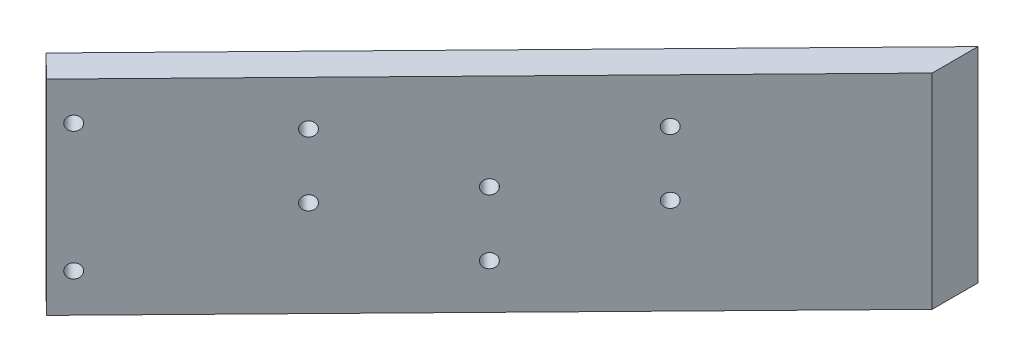
ISO-10303-21;
HEADER;
FILE_DESCRIPTION(('STEP AP214'),'2;1');
FILE_NAME('part.step','',(''),(''),'','','');
FILE_SCHEMA(('AUTOMOTIVE_DESIGN { 1 0 10303 214 1 1 1 1 }'));
ENDSEC;
DATA;
#1=APPLICATION_CONTEXT('core data for automotive mechanical design processes');
#2=APPLICATION_PROTOCOL_DEFINITION('international standard','automotive_design',2000,#1);
#3=PRODUCT_CONTEXT('',#1,'mechanical');
#4=PRODUCT('Part','Part','',(#3));
#5=PRODUCT_RELATED_PRODUCT_CATEGORY('part','',(#4));
#6=PRODUCT_DEFINITION_FORMATION('','',#4);
#7=PRODUCT_DEFINITION_CONTEXT('part definition',#1,'design');
#8=PRODUCT_DEFINITION('design','',#6,#7);
#9=PRODUCT_DEFINITION_SHAPE('','',#8);
#10=(LENGTH_UNIT() NAMED_UNIT(*) SI_UNIT(.MILLI.,.METRE.));
#11=(NAMED_UNIT(*) PLANE_ANGLE_UNIT() SI_UNIT($,.RADIAN.));
#12=(NAMED_UNIT(*) SI_UNIT($,.STERADIAN.) SOLID_ANGLE_UNIT());
#13=UNCERTAINTY_MEASURE_WITH_UNIT(LENGTH_MEASURE(1.E-05),#10,'distance_accuracy_value','');
#14=(GEOMETRIC_REPRESENTATION_CONTEXT(3) GLOBAL_UNCERTAINTY_ASSIGNED_CONTEXT((#13)) GLOBAL_UNIT_ASSIGNED_CONTEXT((#10,
#11,#12)) REPRESENTATION_CONTEXT('',''));
#15=CARTESIAN_POINT('',(0.,0.,0.));
#16=DIRECTION('',(0.,0.,1.));
#17=DIRECTION('',(1.,0.,0.));
#18=AXIS2_PLACEMENT_3D('',#15,#16,#17);
#19=CARTESIAN_POINT('',(0.,32.,-30.));
#20=DIRECTION('',(0.715474021164313,0.,0.698639338313388));
#21=DIRECTION('',(0.698639338313388,0.,-0.715474021164313));
#22=AXIS2_PLACEMENT_3D('',#19,#20,#21);
#23=PLANE('',#22);
#24=CARTESIAN_POINT('',(45.2113149470892,7.,-76.3007442229227));
#25=DIRECTION('',(0.715474021164313,0.,0.698639338313388));
#26=DIRECTION('',(0.698639338313388,0.,-0.715474021164313));
#27=AXIS2_PLACEMENT_3D('',#24,#25,#26);
#28=CIRCLE('',#27,1.10000000000001);
#29=CARTESIAN_POINT('',(45.9798182192339,7.,-77.0877656462034));
#30=VERTEX_POINT('',#29);
#31=EDGE_CURVE('E107',#30,#30,#28,.T.);
#32=ORIENTED_EDGE('',*,*,#31,.T.);
#33=EDGE_LOOP('',(#32));
#34=FACE_BOUND('',#33,.T.);
#35=CARTESIAN_POINT('',(31.2385281808215,15.,-61.9912637996364));
#36=DIRECTION('',(0.715474021164313,0.,0.698639338313388));
#37=DIRECTION('',(0.698639338313388,0.,-0.715474021164313));
#38=AXIS2_PLACEMENT_3D('',#35,#36,#37);
#39=CIRCLE('',#38,1.1);
#40=CARTESIAN_POINT('',(32.0070314529662,15.,-62.7782852229172));
#41=VERTEX_POINT('',#40);
#42=EDGE_CURVE('E152',#41,#41,#39,.T.);
#43=ORIENTED_EDGE('',*,*,#42,.T.);
#44=EDGE_LOOP('',(#43));
#45=FACE_BOUND('',#44,.T.);
#46=CARTESIAN_POINT('',(31.2385281808215,25.,-61.9912637996364));
#47=DIRECTION('',(0.715474021164313,0.,0.698639338313388));
#48=DIRECTION('',(0.698639338313388,0.,-0.715474021164313));
#49=AXIS2_PLACEMENT_3D('',#46,#47,#48);
#50=CIRCLE('',#49,1.1);
#51=CARTESIAN_POINT('',(32.0070314529662,25.,-62.7782852229172));
#52=VERTEX_POINT('',#51);
#53=EDGE_CURVE('E156',#52,#52,#50,.T.);
#54=ORIENTED_EDGE('',*,*,#53,.T.);
#55=EDGE_LOOP('',(#54));
#56=FACE_BOUND('',#55,.T.);
#57=CARTESIAN_POINT('',(59.184101713357,25.,-90.6102246462089));
#58=DIRECTION('',(0.715474021164313,0.,0.698639338313388));
#59=DIRECTION('',(0.698639338313388,0.,-0.715474021164313));
#60=AXIS2_PLACEMENT_3D('',#57,#58,#59);
#61=CIRCLE('',#60,1.10000000000001);
#62=CARTESIAN_POINT('',(59.9526049855017,25.,-91.3972460694897));
#63=VERTEX_POINT('',#62);
#64=EDGE_CURVE('E160',#63,#63,#61,.T.);
#65=ORIENTED_EDGE('',*,*,#64,.T.);
#66=EDGE_LOOP('',(#65));
#67=FACE_BOUND('',#66,.T.);
#68=CARTESIAN_POINT('',(59.184101713357,15.,-90.6102246462089));
#69=DIRECTION('',(0.715474021164313,0.,0.698639338313388));
#70=DIRECTION('',(0.698639338313388,0.,-0.715474021164313));
#71=AXIS2_PLACEMENT_3D('',#68,#69,#70);
#72=CIRCLE('',#71,1.10000000000001);
#73=CARTESIAN_POINT('',(59.9526049855017,15.,-91.3972460694897));
#74=VERTEX_POINT('',#73);
#75=EDGE_CURVE('E164',#74,#74,#72,.T.);
#76=ORIENTED_EDGE('',*,*,#75,.T.);
#77=EDGE_LOOP('',(#76));
#78=FACE_BOUND('',#77,.T.);
#79=CARTESIAN_POINT('',(45.2113149470892,17.,-76.3007442229227));
#80=DIRECTION('',(0.715474021164313,0.,0.698639338313388));
#81=DIRECTION('',(0.698639338313388,0.,-0.715474021164313));
#82=AXIS2_PLACEMENT_3D('',#79,#80,#81);
#83=CIRCLE('',#82,1.10000000000001);
#84=CARTESIAN_POINT('',(45.9798182192339,17.,-77.0877656462034));
#85=VERTEX_POINT('',#84);
#86=EDGE_CURVE('E168',#85,#85,#83,.T.);
#87=ORIENTED_EDGE('',*,*,#86,.T.);
#88=EDGE_LOOP('',(#87));
#89=FACE_BOUND('',#88,.T.);
#90=CARTESIAN_POINT('',(13.0959180149402,26.,-43.4114823044568));
#91=DIRECTION('',(-0.715474021164313,0.,-0.698639338313388));
#92=DIRECTION('',(-0.698639338313388,0.,0.715474021164313));
#93=AXIS2_PLACEMENT_3D('',#90,#91,#92);
#94=CIRCLE('',#93,1.1);
#95=CARTESIAN_POINT('',(12.3274147427954,26.,-42.624460881176));
#96=VERTEX_POINT('',#95);
#97=EDGE_CURVE('E96',#96,#96,#94,.T.);
#98=ORIENTED_EDGE('',*,*,#97,.F.);
#99=EDGE_LOOP('',(#98));
#100=FACE_BOUND('',#99,.T.);
#101=CARTESIAN_POINT('',(13.0959180149402,6.,-43.4114823044568));
#102=DIRECTION('',(-0.715474021164313,0.,-0.698639338313388));
#103=DIRECTION('',(0.698639338313388,0.,-0.715474021164313));
#104=AXIS2_PLACEMENT_3D('',#101,#102,#103);
#105=CIRCLE('',#104,1.1);
#106=CARTESIAN_POINT('',(13.8644212870849,6.,-44.1985037277375));
#107=VERTEX_POINT('',#106);
#108=EDGE_CURVE('E102',#107,#107,#105,.T.);
#109=ORIENTED_EDGE('',*,*,#108,.F.);
#110=EDGE_LOOP('',(#109));
#111=FACE_BOUND('',#110,.T.);
#112=DIRECTION('',(0.,1.,0.));
#113=VECTOR('',#112,1.);
#114=CARTESIAN_POINT('',(11.,0.,-41.2650602409638));
#115=LINE('',#114,#113);
#116=CARTESIAN_POINT('',(11.,0.,-41.2650602409638));
#117=VERTEX_POINT('',#116);
#118=CARTESIAN_POINT('',(11.,32.,-41.2650602409638));
#119=VERTEX_POINT('',#118);
#120=EDGE_CURVE('E50',#117,#119,#115,.T.);
#121=ORIENTED_EDGE('',*,*,#120,.T.);
#122=DIRECTION('',(-0.698639338313388,0.,0.715474021164313));
#123=VECTOR('',#122,1.);
#124=CARTESIAN_POINT('',(0.,32.,-30.));
#125=LINE('',#124,#123);
#126=CARTESIAN_POINT('',(83.,32.,-115.));
#127=VERTEX_POINT('',#126);
#128=EDGE_CURVE('E79',#127,#119,#125,.T.);
#129=ORIENTED_EDGE('',*,*,#128,.F.);
#130=DIRECTION('',(0.,-1.,0.));
#131=VECTOR('',#130,1.);
#132=CARTESIAN_POINT('',(83.,32.,-115.));
#133=LINE('',#132,#131);
#134=CARTESIAN_POINT('',(83.,0.,-115.));
#135=VERTEX_POINT('',#134);
#136=EDGE_CURVE('E42',#127,#135,#133,.T.);
#137=ORIENTED_EDGE('',*,*,#136,.T.);
#138=DIRECTION('',(-0.698639338313388,0.,0.715474021164313));
#139=VECTOR('',#138,1.);
#140=CARTESIAN_POINT('',(0.,0.,-30.));
#141=LINE('',#140,#139);
#142=EDGE_CURVE('E84',#135,#117,#141,.T.);
#143=ORIENTED_EDGE('',*,*,#142,.T.);
#144=EDGE_LOOP('',(#121,#129,#137,#143));
#145=FACE_BOUND('',#144,.T.);
#146=ADVANCED_FACE('F34',(#34,#45,#56,#67,#78,#89,#100,#111,#145),#23,.F.);
#147=CARTESIAN_POINT('',(5.,32.,-27.9637134410254));
#148=DIRECTION('',(-0.715474021164313,0.,-0.698639338313388));
#149=DIRECTION('',(-0.698639338313388,0.,0.715474021164313));
#150=AXIS2_PLACEMENT_3D('',#147,#148,#149);
#151=PLANE('',#150);
#152=CARTESIAN_POINT('',(48.7886850529108,7.,-72.8075475313557));
#153=DIRECTION('',(0.715474021164313,0.,0.698639338313388));
#154=DIRECTION('',(-0.698639338313388,0.,0.715474021164313));
#155=AXIS2_PLACEMENT_3D('',#152,#153,#154);
#156=CIRCLE('',#155,1.10000000000001);
#157=CARTESIAN_POINT('',(48.020181780766,7.,-72.020526108075));
#158=VERTEX_POINT('',#157);
#159=EDGE_CURVE('E182',#158,#158,#156,.T.);
#160=ORIENTED_EDGE('',*,*,#159,.F.);
#161=EDGE_LOOP('',(#160));
#162=FACE_BOUND('',#161,.T.);
#163=CARTESIAN_POINT('',(34.815898286643,15.,-58.4980671080695));
#164=DIRECTION('',(0.715474021164313,0.,0.698639338313388));
#165=DIRECTION('',(0.698639338313388,0.,-0.715474021164313));
#166=AXIS2_PLACEMENT_3D('',#163,#164,#165);
#167=CIRCLE('',#166,1.1);
#168=CARTESIAN_POINT('',(35.5844015587877,15.,-59.2850885313502));
#169=VERTEX_POINT('',#168);
#170=EDGE_CURVE('E177',#169,#169,#167,.T.);
#171=ORIENTED_EDGE('',*,*,#170,.F.);
#172=EDGE_LOOP('',(#171));
#173=FACE_BOUND('',#172,.T.);
#174=CARTESIAN_POINT('',(34.815898286643,25.,-58.4980671080695));
#175=DIRECTION('',(0.715474021164313,0.,0.698639338313388));
#176=DIRECTION('',(-0.698639338313388,0.,0.715474021164313));
#177=AXIS2_PLACEMENT_3D('',#174,#175,#176);
#178=CIRCLE('',#177,1.1);
#179=CARTESIAN_POINT('',(34.0473950144983,25.,-57.7110456847887));
#180=VERTEX_POINT('',#179);
#181=EDGE_CURVE('E186',#180,#180,#178,.T.);
#182=ORIENTED_EDGE('',*,*,#181,.F.);
#183=EDGE_LOOP('',(#182));
#184=FACE_BOUND('',#183,.T.);
#185=CARTESIAN_POINT('',(62.7614718191785,25.,-87.117027954642));
#186=DIRECTION('',(0.715474021164313,0.,0.698639338313388));
#187=DIRECTION('',(0.698639338313388,0.,-0.715474021164313));
#188=AXIS2_PLACEMENT_3D('',#185,#186,#187);
#189=CIRCLE('',#188,1.10000000000001);
#190=CARTESIAN_POINT('',(63.5299750913233,25.,-87.9040493779227));
#191=VERTEX_POINT('',#190);
#192=EDGE_CURVE('E189',#191,#191,#189,.T.);
#193=ORIENTED_EDGE('',*,*,#192,.F.);
#194=EDGE_LOOP('',(#193));
#195=FACE_BOUND('',#194,.T.);
#196=CARTESIAN_POINT('',(62.7614718191785,15.,-87.117027954642));
#197=DIRECTION('',(0.715474021164313,0.,0.698639338313388));
#198=DIRECTION('',(-0.698639338313388,0.,0.715474021164313));
#199=AXIS2_PLACEMENT_3D('',#196,#197,#198);
#200=CIRCLE('',#199,1.10000000000001);
#201=CARTESIAN_POINT('',(61.9929685470338,15.,-86.3300065313612));
#202=VERTEX_POINT('',#201);
#203=EDGE_CURVE('E185',#202,#202,#200,.T.);
#204=ORIENTED_EDGE('',*,*,#203,.F.);
#205=EDGE_LOOP('',(#204));
#206=FACE_BOUND('',#205,.T.);
#207=CARTESIAN_POINT('',(48.7886850529108,17.,-72.8075475313557));
#208=DIRECTION('',(0.715474021164313,0.,0.698639338313388));
#209=DIRECTION('',(0.698639338313388,0.,-0.715474021164313));
#210=AXIS2_PLACEMENT_3D('',#207,#208,#209);
#211=CIRCLE('',#210,1.10000000000001);
#212=CARTESIAN_POINT('',(49.5571883250555,17.,-73.5945689546365));
#213=VERTEX_POINT('',#212);
#214=EDGE_CURVE('E173',#213,#213,#211,.T.);
#215=ORIENTED_EDGE('',*,*,#214,.F.);
#216=EDGE_LOOP('',(#215));
#217=FACE_BOUND('',#216,.T.);
#218=CARTESIAN_POINT('',(16.6732881207617,26.,-39.9182856128899));
#219=DIRECTION('',(-0.715474021164313,0.,-0.698639338313388));
#220=DIRECTION('',(-0.698639338313388,0.,0.715474021164313));
#221=AXIS2_PLACEMENT_3D('',#218,#219,#220);
#222=CIRCLE('',#221,1.1);
#223=CARTESIAN_POINT('',(15.904784848617,26.,-39.1312641896091));
#224=VERTEX_POINT('',#223);
#225=EDGE_CURVE('E37',#224,#224,#222,.T.);
#226=ORIENTED_EDGE('',*,*,#225,.T.);
#227=EDGE_LOOP('',(#226));
#228=FACE_BOUND('',#227,.T.);
#229=CARTESIAN_POINT('',(16.6732881207617,6.,-39.9182856128899));
#230=DIRECTION('',(-0.715474021164313,0.,-0.698639338313388));
#231=DIRECTION('',(-0.698639338313388,0.,0.715474021164313));
#232=AXIS2_PLACEMENT_3D('',#229,#230,#231);
#233=CIRCLE('',#232,1.1);
#234=CARTESIAN_POINT('',(15.904784848617,6.,-39.1312641896091));
#235=VERTEX_POINT('',#234);
#236=EDGE_CURVE('E94',#235,#235,#233,.T.);
#237=ORIENTED_EDGE('',*,*,#236,.T.);
#238=EDGE_LOOP('',(#237));
#239=FACE_BOUND('',#238,.T.);
#240=DIRECTION('',(0.,1.,0.));
#241=VECTOR('',#240,1.);
#242=CARTESIAN_POINT('',(14.5773701058216,0.,-37.7718635493969));
#243=LINE('',#242,#241);
#244=CARTESIAN_POINT('',(14.5773701058216,0.,-37.7718635493969));
#245=VERTEX_POINT('',#244);
#246=CARTESIAN_POINT('',(14.5773701058216,32.,-37.7718635493969));
#247=VERTEX_POINT('',#246);
#248=EDGE_CURVE('E90',#245,#247,#243,.T.);
#249=ORIENTED_EDGE('',*,*,#248,.F.);
#250=DIRECTION('',(0.698639338313388,0.,-0.715474021164313));
#251=VECTOR('',#250,1.);
#252=CARTESIAN_POINT('',(5.,0.,-27.9637134410254));
#253=LINE('',#252,#251);
#254=CARTESIAN_POINT('',(83.,0.,-107.843231513315));
#255=VERTEX_POINT('',#254);
#256=EDGE_CURVE('E80',#245,#255,#253,.T.);
#257=ORIENTED_EDGE('',*,*,#256,.T.);
#258=DIRECTION('',(0.,-1.,0.));
#259=VECTOR('',#258,1.);
#260=CARTESIAN_POINT('',(83.,32.,-107.843231513315));
#261=LINE('',#260,#259);
#262=CARTESIAN_POINT('',(83.,32.,-107.843231513315));
#263=VERTEX_POINT('',#262);
#264=EDGE_CURVE('E11',#263,#255,#261,.T.);
#265=ORIENTED_EDGE('',*,*,#264,.F.);
#266=DIRECTION('',(0.698639338313388,0.,-0.715474021164313));
#267=VECTOR('',#266,1.);
#268=CARTESIAN_POINT('',(5.,32.,-27.9637134410254));
#269=LINE('',#268,#267);
#270=EDGE_CURVE('E117',#247,#263,#269,.T.);
#271=ORIENTED_EDGE('',*,*,#270,.F.);
#272=EDGE_LOOP('',(#249,#257,#265,#271));
#273=FACE_BOUND('',#272,.T.);
#274=ADVANCED_FACE('F122',(#162,#173,#184,#195,#206,#217,#228,#239,#273),#151,.F.);
#275=CARTESIAN_POINT('',(0.,32.,0.));
#276=DIRECTION('',(0.,-1.,0.));
#277=DIRECTION('',(0.,0.,-1.));
#278=AXIS2_PLACEMENT_3D('',#275,#276,#277);
#279=PLANE('',#278);
#280=DIRECTION('',(0.715474021164313,0.,0.698639338313388));
#281=VECTOR('',#280,1.);
#282=CARTESIAN_POINT('',(14.5773701058216,32.,-37.7718635493969));
#283=LINE('',#282,#281);
#284=EDGE_CURVE('E100',#119,#247,#283,.T.);
#285=ORIENTED_EDGE('',*,*,#284,.T.);
#286=ORIENTED_EDGE('',*,*,#270,.T.);
#287=DIRECTION('',(0.,0.,-1.));
#288=VECTOR('',#287,1.);
#289=CARTESIAN_POINT('',(83.,32.,-115.));
#290=LINE('',#289,#288);
#291=EDGE_CURVE('E59',#263,#127,#290,.T.);
#292=ORIENTED_EDGE('',*,*,#291,.T.);
#293=ORIENTED_EDGE('',*,*,#128,.T.);
#294=EDGE_LOOP('',(#285,#286,#292,#293));
#295=FACE_BOUND('',#294,.T.);
#296=ADVANCED_FACE('F119',(#295),#279,.F.);
#297=CARTESIAN_POINT('',(0.,0.,0.));
#298=DIRECTION('',(0.,-1.,0.));
#299=DIRECTION('',(0.,0.,-1.));
#300=AXIS2_PLACEMENT_3D('',#297,#298,#299);
#301=PLANE('',#300);
#302=ORIENTED_EDGE('',*,*,#256,.F.);
#303=DIRECTION('',(0.715474021164313,0.,0.698639338313388));
#304=VECTOR('',#303,1.);
#305=CARTESIAN_POINT('',(14.5773701058216,0.,-37.7718635493969));
#306=LINE('',#305,#304);
#307=EDGE_CURVE('E87',#117,#245,#306,.T.);
#308=ORIENTED_EDGE('',*,*,#307,.F.);
#309=ORIENTED_EDGE('',*,*,#142,.F.);
#310=DIRECTION('',(0.,0.,-1.));
#311=VECTOR('',#310,1.);
#312=CARTESIAN_POINT('',(83.,0.,-115.));
#313=LINE('',#312,#311);
#314=EDGE_CURVE('E71',#255,#135,#313,.T.);
#315=ORIENTED_EDGE('',*,*,#314,.F.);
#316=EDGE_LOOP('',(#302,#308,#309,#315));
#317=FACE_BOUND('',#316,.T.);
#318=ADVANCED_FACE('F86',(#317),#301,.T.);
#319=CARTESIAN_POINT('',(83.,32.,-115.));
#320=DIRECTION('',(-1.,0.,0.));
#321=DIRECTION('',(0.,0.,1.));
#322=AXIS2_PLACEMENT_3D('',#319,#320,#321);
#323=PLANE('',#322);
#324=ORIENTED_EDGE('',*,*,#314,.T.);
#325=ORIENTED_EDGE('',*,*,#136,.F.);
#326=ORIENTED_EDGE('',*,*,#291,.F.);
#327=ORIENTED_EDGE('',*,*,#264,.T.);
#328=EDGE_LOOP('',(#324,#325,#326,#327));
#329=FACE_BOUND('',#328,.T.);
#330=ADVANCED_FACE('F73',(#329),#323,.F.);
#331=CARTESIAN_POINT('',(14.5773701058216,0.,-37.7718635493969));
#332=DIRECTION('',(-0.698639338313388,0.,0.715474021164313));
#333=DIRECTION('',(0.715474021164313,0.,0.698639338313388));
#334=AXIS2_PLACEMENT_3D('',#331,#332,#333);
#335=PLANE('',#334);
#336=ORIENTED_EDGE('',*,*,#284,.F.);
#337=ORIENTED_EDGE('',*,*,#120,.F.);
#338=ORIENTED_EDGE('',*,*,#307,.T.);
#339=ORIENTED_EDGE('',*,*,#248,.T.);
#340=EDGE_LOOP('',(#336,#337,#338,#339));
#341=FACE_BOUND('',#340,.T.);
#342=ADVANCED_FACE('F127',(#341),#335,.T.);
#343=CARTESIAN_POINT('',(51.6990427605123,6.,-5.71666637642754));
#344=DIRECTION('',(-0.715474021164313,0.,-0.698639338313388));
#345=DIRECTION('',(-0.698639338313388,0.,0.715474021164313));
#346=AXIS2_PLACEMENT_3D('',#343,#344,#345);
#347=CYLINDRICAL_SURFACE('',#346,1.1);
#348=ORIENTED_EDGE('',*,*,#108,.T.);
#349=EDGE_LOOP('',(#348));
#350=FACE_BOUND('',#349,.T.);
#351=ORIENTED_EDGE('',*,*,#236,.F.);
#352=EDGE_LOOP('',(#351));
#353=FACE_BOUND('',#352,.T.);
#354=ADVANCED_FACE('F129',(#350,#353),#347,.F.);
#355=CARTESIAN_POINT('',(51.6990427605123,26.,-5.71666637642754));
#356=DIRECTION('',(-0.715474021164313,0.,-0.698639338313388));
#357=DIRECTION('',(-0.698639338313388,0.,0.715474021164313));
#358=AXIS2_PLACEMENT_3D('',#355,#356,#357);
#359=CYLINDRICAL_SURFACE('',#358,1.1);
#360=ORIENTED_EDGE('',*,*,#97,.T.);
#361=EDGE_LOOP('',(#360));
#362=FACE_BOUND('',#361,.T.);
#363=ORIENTED_EDGE('',*,*,#225,.F.);
#364=EDGE_LOOP('',(#363));
#365=FACE_BOUND('',#364,.T.);
#366=ADVANCED_FACE('F135',(#362,#365),#359,.F.);
#367=CARTESIAN_POINT('',(8.35429354989493,17.,-112.290541587242));
#368=DIRECTION('',(0.715474021164313,0.,0.698639338313388));
#369=DIRECTION('',(0.698639338313388,0.,-0.715474021164313));
#370=AXIS2_PLACEMENT_3D('',#367,#368,#369);
#371=CYLINDRICAL_SURFACE('',#370,1.10000000000001);
#372=ORIENTED_EDGE('',*,*,#214,.T.);
#373=EDGE_LOOP('',(#372));
#374=FACE_BOUND('',#373,.T.);
#375=ORIENTED_EDGE('',*,*,#86,.F.);
#376=EDGE_LOOP('',(#375));
#377=FACE_BOUND('',#376,.T.);
#378=ADVANCED_FACE('F208',(#374,#377),#371,.F.);
#379=CARTESIAN_POINT('',(22.3270803161627,15.,-126.600022010528));
#380=DIRECTION('',(0.715474021164313,0.,0.698639338313388));
#381=DIRECTION('',(0.698639338313388,0.,-0.715474021164313));
#382=AXIS2_PLACEMENT_3D('',#379,#380,#381);
#383=CYLINDRICAL_SURFACE('',#382,1.10000000000001);
#384=ORIENTED_EDGE('',*,*,#203,.T.);
#385=EDGE_LOOP('',(#384));
#386=FACE_BOUND('',#385,.T.);
#387=ORIENTED_EDGE('',*,*,#75,.F.);
#388=EDGE_LOOP('',(#387));
#389=FACE_BOUND('',#388,.T.);
#390=ADVANCED_FACE('F213',(#386,#389),#383,.F.);
#391=CARTESIAN_POINT('',(22.3270803161627,25.,-126.600022010528));
#392=DIRECTION('',(0.715474021164313,0.,0.698639338313388));
#393=DIRECTION('',(0.698639338313388,0.,-0.715474021164313));
#394=AXIS2_PLACEMENT_3D('',#391,#392,#393);
#395=CYLINDRICAL_SURFACE('',#394,1.10000000000001);
#396=ORIENTED_EDGE('',*,*,#192,.T.);
#397=EDGE_LOOP('',(#396));
#398=FACE_BOUND('',#397,.T.);
#399=ORIENTED_EDGE('',*,*,#64,.F.);
#400=EDGE_LOOP('',(#399));
#401=FACE_BOUND('',#400,.T.);
#402=ADVANCED_FACE('F197',(#398,#401),#395,.F.);
#403=CARTESIAN_POINT('',(-5.61849321637283,25.,-97.9810611639556));
#404=DIRECTION('',(0.715474021164313,0.,0.698639338313388));
#405=DIRECTION('',(0.698639338313388,0.,-0.715474021164313));
#406=AXIS2_PLACEMENT_3D('',#403,#404,#405);
#407=CYLINDRICAL_SURFACE('',#406,1.1);
#408=ORIENTED_EDGE('',*,*,#181,.T.);
#409=EDGE_LOOP('',(#408));
#410=FACE_BOUND('',#409,.T.);
#411=ORIENTED_EDGE('',*,*,#53,.F.);
#412=EDGE_LOOP('',(#411));
#413=FACE_BOUND('',#412,.T.);
#414=ADVANCED_FACE('F222',(#410,#413),#407,.F.);
#415=CARTESIAN_POINT('',(-5.61849321637283,15.,-97.9810611639556));
#416=DIRECTION('',(0.715474021164313,0.,0.698639338313388));
#417=DIRECTION('',(0.698639338313388,0.,-0.715474021164313));
#418=AXIS2_PLACEMENT_3D('',#415,#416,#417);
#419=CYLINDRICAL_SURFACE('',#418,1.1);
#420=ORIENTED_EDGE('',*,*,#170,.T.);
#421=EDGE_LOOP('',(#420));
#422=FACE_BOUND('',#421,.T.);
#423=ORIENTED_EDGE('',*,*,#42,.F.);
#424=EDGE_LOOP('',(#423));
#425=FACE_BOUND('',#424,.T.);
#426=ADVANCED_FACE('F220',(#422,#425),#419,.F.);
#427=CARTESIAN_POINT('',(8.35429354989493,7.,-112.290541587242));
#428=DIRECTION('',(0.715474021164313,0.,0.698639338313388));
#429=DIRECTION('',(0.698639338313388,0.,-0.715474021164313));
#430=AXIS2_PLACEMENT_3D('',#427,#428,#429);
#431=CYLINDRICAL_SURFACE('',#430,1.10000000000001);
#432=ORIENTED_EDGE('',*,*,#159,.T.);
#433=EDGE_LOOP('',(#432));
#434=FACE_BOUND('',#433,.T.);
#435=ORIENTED_EDGE('',*,*,#31,.F.);
#436=EDGE_LOOP('',(#435));
#437=FACE_BOUND('',#436,.T.);
#438=ADVANCED_FACE('F217',(#434,#437),#431,.F.);
#439=CLOSED_SHELL('',(#146,#274,#296,#318,#330,#342,#354,#366,#378,#390,#402,#414,#426,#438));
#440=MANIFOLD_SOLID_BREP('B2',#439);
#441=ADVANCED_BREP_SHAPE_REPRESENTATION('',(#18,#440),#14);
#442=SHAPE_DEFINITION_REPRESENTATION(#9,#441);
ENDSEC;
END-ISO-10303-21;
